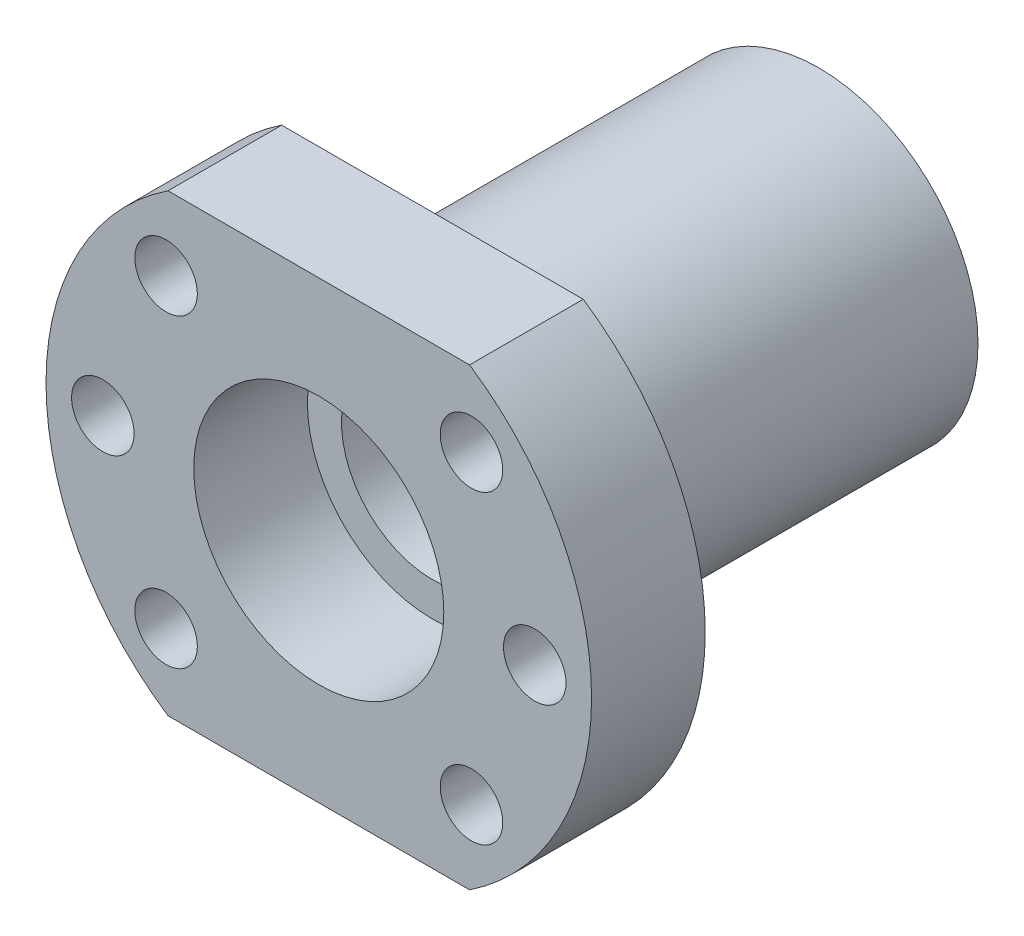
ISO-10303-21;
HEADER;
FILE_DESCRIPTION(('STEP AP214'),'2;1');
FILE_NAME('part.step','',(''),(''),'','','');
FILE_SCHEMA(('AUTOMOTIVE_DESIGN { 1 0 10303 214 1 1 1 1 }'));
ENDSEC;
DATA;
#1=APPLICATION_CONTEXT('core data for automotive mechanical design processes');
#2=APPLICATION_PROTOCOL_DEFINITION('international standard','automotive_design',2000,#1);
#3=PRODUCT_CONTEXT('',#1,'mechanical');
#4=PRODUCT('Part','Part','',(#3));
#5=PRODUCT_RELATED_PRODUCT_CATEGORY('part','',(#4));
#6=PRODUCT_DEFINITION_FORMATION('','',#4);
#7=PRODUCT_DEFINITION_CONTEXT('part definition',#1,'design');
#8=PRODUCT_DEFINITION('design','',#6,#7);
#9=PRODUCT_DEFINITION_SHAPE('','',#8);
#10=(LENGTH_UNIT() NAMED_UNIT(*) SI_UNIT(.MILLI.,.METRE.));
#11=(NAMED_UNIT(*) PLANE_ANGLE_UNIT() SI_UNIT($,.RADIAN.));
#12=(NAMED_UNIT(*) SI_UNIT($,.STERADIAN.) SOLID_ANGLE_UNIT());
#13=UNCERTAINTY_MEASURE_WITH_UNIT(LENGTH_MEASURE(1.E-05),#10,'distance_accuracy_value','');
#14=(GEOMETRIC_REPRESENTATION_CONTEXT(3) GLOBAL_UNCERTAINTY_ASSIGNED_CONTEXT((#13)) GLOBAL_UNIT_ASSIGNED_CONTEXT((#10,
#11,#12)) REPRESENTATION_CONTEXT('',''));
#15=CARTESIAN_POINT('',(0.,0.,0.));
#16=DIRECTION('',(0.,0.,1.));
#17=DIRECTION('',(1.,0.,0.));
#18=AXIS2_PLACEMENT_3D('',#15,#16,#17);
#19=CARTESIAN_POINT('',(0.,0.,17.9282770822245));
#20=DIRECTION('',(0.,0.,1.));
#21=DIRECTION('',(1.,0.,0.));
#22=AXIS2_PLACEMENT_3D('',#19,#20,#21);
#23=CYLINDRICAL_SURFACE('',#22,24.);
#24=CARTESIAN_POINT('',(0.,0.,12.));
#25=DIRECTION('',(0.,0.,1.));
#26=DIRECTION('',(1.,0.,0.));
#27=AXIS2_PLACEMENT_3D('',#24,#25,#26);
#28=CIRCLE('',#27,24.);
#29=CARTESIAN_POINT('',(-13.2664991614216,20.,12.));
#30=VERTEX_POINT('',#29);
#31=CARTESIAN_POINT('',(-13.2664991614216,-20.,12.));
#32=VERTEX_POINT('',#31);
#33=EDGE_CURVE('E93',#30,#32,#28,.T.);
#34=ORIENTED_EDGE('',*,*,#33,.T.);
#35=DIRECTION('',(0.,0.,1.));
#36=VECTOR('',#35,1.);
#37=CARTESIAN_POINT('',(-13.2664991614216,-20.,17.9282770822245));
#38=LINE('',#37,#36);
#39=CARTESIAN_POINT('',(-13.2664991614216,-20.,22.));
#40=VERTEX_POINT('',#39);
#41=EDGE_CURVE('E51',#32,#40,#38,.T.);
#42=ORIENTED_EDGE('',*,*,#41,.T.);
#43=CARTESIAN_POINT('',(0.,0.,22.));
#44=DIRECTION('',(0.,0.,1.));
#45=DIRECTION('',(1.,0.,0.));
#46=AXIS2_PLACEMENT_3D('',#43,#44,#45);
#47=CIRCLE('',#46,24.);
#48=CARTESIAN_POINT('',(-13.2664991614216,20.,22.));
#49=VERTEX_POINT('',#48);
#50=EDGE_CURVE('E88',#49,#40,#47,.T.);
#51=ORIENTED_EDGE('',*,*,#50,.F.);
#52=DIRECTION('',(0.,0.,1.));
#53=VECTOR('',#52,1.);
#54=CARTESIAN_POINT('',(-13.2664991614216,20.,17.9282770822245));
#55=LINE('',#54,#53);
#56=EDGE_CURVE('E149',#49,#30,#55,.F.);
#57=ORIENTED_EDGE('',*,*,#56,.T.);
#58=EDGE_LOOP('',(#34,#42,#51,#57));
#59=FACE_BOUND('',#58,.T.);
#60=ADVANCED_FACE('F34',(#59),#23,.T.);
#61=CARTESIAN_POINT('',(0.,14.,-22.));
#62=DIRECTION('',(0.,0.,1.));
#63=DIRECTION('',(1.,0.,0.));
#64=AXIS2_PLACEMENT_3D('',#61,#62,#63);
#65=PLANE('',#64);
#66=CARTESIAN_POINT('',(0.,0.,-22.));
#67=DIRECTION('',(0.,0.,1.));
#68=DIRECTION('',(1.,0.,0.));
#69=AXIS2_PLACEMENT_3D('',#66,#67,#68);
#70=CIRCLE('',#69,14.);
#71=CARTESIAN_POINT('',(14.,0.,-22.));
#72=VERTEX_POINT('',#71);
#73=EDGE_CURVE('E153',#72,#72,#70,.T.);
#74=ORIENTED_EDGE('',*,*,#73,.F.);
#75=EDGE_LOOP('',(#74));
#76=FACE_BOUND('',#75,.T.);
#77=CARTESIAN_POINT('',(0.,0.,-22.));
#78=DIRECTION('',(0.,0.,1.));
#79=DIRECTION('',(1.,0.,0.));
#80=AXIS2_PLACEMENT_3D('',#77,#78,#79);
#81=CIRCLE('',#80,11.);
#82=CARTESIAN_POINT('',(11.,0.,-22.));
#83=VERTEX_POINT('',#82);
#84=EDGE_CURVE('E114',#83,#83,#81,.T.);
#85=ORIENTED_EDGE('',*,*,#84,.T.);
#86=EDGE_LOOP('',(#85));
#87=FACE_BOUND('',#86,.T.);
#88=ADVANCED_FACE('F36',(#76,#87),#65,.F.);
#89=CARTESIAN_POINT('',(0.,0.,17.9282770822245));
#90=DIRECTION('',(0.,0.,1.));
#91=DIRECTION('',(1.,0.,0.));
#92=AXIS2_PLACEMENT_3D('',#89,#90,#91);
#93=CYLINDRICAL_SURFACE('',#92,11.);
#94=ORIENTED_EDGE('',*,*,#84,.F.);
#95=EDGE_LOOP('',(#94));
#96=FACE_BOUND('',#95,.T.);
#97=CARTESIAN_POINT('',(0.,0.,-12.));
#98=DIRECTION('',(0.,0.,1.));
#99=DIRECTION('',(1.,0.,0.));
#100=AXIS2_PLACEMENT_3D('',#97,#98,#99);
#101=CIRCLE('',#100,11.);
#102=CARTESIAN_POINT('',(11.,0.,-12.));
#103=VERTEX_POINT('',#102);
#104=EDGE_CURVE('E111',#103,#103,#101,.T.);
#105=ORIENTED_EDGE('',*,*,#104,.T.);
#106=EDGE_LOOP('',(#105));
#107=FACE_BOUND('',#106,.T.);
#108=ADVANCED_FACE('F170',(#96,#107),#93,.F.);
#109=CARTESIAN_POINT('',(0.,11.,-12.));
#110=DIRECTION('',(0.,0.,1.));
#111=DIRECTION('',(1.,0.,0.));
#112=AXIS2_PLACEMENT_3D('',#109,#110,#111);
#113=PLANE('',#112);
#114=ORIENTED_EDGE('',*,*,#104,.F.);
#115=EDGE_LOOP('',(#114));
#116=FACE_BOUND('',#115,.T.);
#117=CARTESIAN_POINT('',(0.,0.,-12.));
#118=DIRECTION('',(0.,0.,1.));
#119=DIRECTION('',(1.,0.,0.));
#120=AXIS2_PLACEMENT_3D('',#117,#118,#119);
#121=CIRCLE('',#120,8.);
#122=CARTESIAN_POINT('',(8.,0.,-12.));
#123=VERTEX_POINT('',#122);
#124=EDGE_CURVE('E108',#123,#123,#121,.T.);
#125=ORIENTED_EDGE('',*,*,#124,.T.);
#126=EDGE_LOOP('',(#125));
#127=FACE_BOUND('',#126,.T.);
#128=ADVANCED_FACE('F175',(#116,#127),#113,.F.);
#129=CARTESIAN_POINT('',(0.,0.,17.9282770822245));
#130=DIRECTION('',(0.,0.,1.));
#131=DIRECTION('',(1.,0.,0.));
#132=AXIS2_PLACEMENT_3D('',#129,#130,#131);
#133=CYLINDRICAL_SURFACE('',#132,8.);
#134=ORIENTED_EDGE('',*,*,#124,.F.);
#135=EDGE_LOOP('',(#134));
#136=FACE_BOUND('',#135,.T.);
#137=CARTESIAN_POINT('',(0.,0.,12.));
#138=DIRECTION('',(0.,0.,1.));
#139=DIRECTION('',(1.,0.,0.));
#140=AXIS2_PLACEMENT_3D('',#137,#138,#139);
#141=CIRCLE('',#140,8.);
#142=CARTESIAN_POINT('',(8.,0.,12.));
#143=VERTEX_POINT('',#142);
#144=EDGE_CURVE('E105',#143,#143,#141,.T.);
#145=ORIENTED_EDGE('',*,*,#144,.T.);
#146=EDGE_LOOP('',(#145));
#147=FACE_BOUND('',#146,.T.);
#148=ADVANCED_FACE('F180',(#136,#147),#133,.F.);
#149=CARTESIAN_POINT('',(0.,11.,12.));
#150=DIRECTION('',(0.,0.,-1.));
#151=DIRECTION('',(-1.,0.,0.));
#152=AXIS2_PLACEMENT_3D('',#149,#150,#151);
#153=PLANE('',#152);
#154=ORIENTED_EDGE('',*,*,#144,.F.);
#155=EDGE_LOOP('',(#154));
#156=FACE_BOUND('',#155,.T.);
#157=CARTESIAN_POINT('',(0.,0.,12.));
#158=DIRECTION('',(0.,0.,1.));
#159=DIRECTION('',(1.,0.,0.));
#160=AXIS2_PLACEMENT_3D('',#157,#158,#159);
#161=CIRCLE('',#160,11.);
#162=CARTESIAN_POINT('',(11.,0.,12.));
#163=VERTEX_POINT('',#162);
#164=EDGE_CURVE('E102',#163,#163,#161,.T.);
#165=ORIENTED_EDGE('',*,*,#164,.T.);
#166=EDGE_LOOP('',(#165));
#167=FACE_BOUND('',#166,.T.);
#168=ADVANCED_FACE('F186',(#156,#167),#153,.F.);
#169=CARTESIAN_POINT('',(0.,0.,17.9282770822245));
#170=DIRECTION('',(0.,0.,1.));
#171=DIRECTION('',(1.,0.,0.));
#172=AXIS2_PLACEMENT_3D('',#169,#170,#171);
#173=CYLINDRICAL_SURFACE('',#172,11.);
#174=ORIENTED_EDGE('',*,*,#164,.F.);
#175=EDGE_LOOP('',(#174));
#176=FACE_BOUND('',#175,.T.);
#177=CARTESIAN_POINT('',(0.,0.,22.));
#178=DIRECTION('',(0.,0.,1.));
#179=DIRECTION('',(1.,0.,0.));
#180=AXIS2_PLACEMENT_3D('',#177,#178,#179);
#181=CIRCLE('',#180,11.);
#182=CARTESIAN_POINT('',(11.,0.,22.));
#183=VERTEX_POINT('',#182);
#184=EDGE_CURVE('E95',#183,#183,#181,.T.);
#185=ORIENTED_EDGE('',*,*,#184,.T.);
#186=EDGE_LOOP('',(#185));
#187=FACE_BOUND('',#186,.T.);
#188=ADVANCED_FACE('F192',(#176,#187),#173,.F.);
#189=CARTESIAN_POINT('',(0.,11.,22.));
#190=DIRECTION('',(0.,0.,-1.));
#191=DIRECTION('',(-1.,0.,0.));
#192=AXIS2_PLACEMENT_3D('',#189,#190,#191);
#193=PLANE('',#192);
#194=CARTESIAN_POINT('',(-13.4350288425444,13.4350288425444,22.));
#195=DIRECTION('',(0.,0.,1.));
#196=DIRECTION('',(1.,0.,0.));
#197=AXIS2_PLACEMENT_3D('',#194,#195,#196);
#198=CIRCLE('',#197,2.75);
#199=CARTESIAN_POINT('',(-10.6850288425444,13.4350288425444,22.));
#200=VERTEX_POINT('',#199);
#201=EDGE_CURVE('E126',#200,#200,#198,.T.);
#202=ORIENTED_EDGE('',*,*,#201,.F.);
#203=EDGE_LOOP('',(#202));
#204=FACE_BOUND('',#203,.T.);
#205=CARTESIAN_POINT('',(13.4350288425444,13.4350288425444,22.));
#206=DIRECTION('',(0.,0.,1.));
#207=DIRECTION('',(1.,0.,0.));
#208=AXIS2_PLACEMENT_3D('',#205,#206,#207);
#209=CIRCLE('',#208,2.75);
#210=CARTESIAN_POINT('',(16.1850288425444,13.4350288425444,22.));
#211=VERTEX_POINT('',#210);
#212=EDGE_CURVE('E248',#211,#211,#209,.T.);
#213=ORIENTED_EDGE('',*,*,#212,.F.);
#214=EDGE_LOOP('',(#213));
#215=FACE_BOUND('',#214,.T.);
#216=CARTESIAN_POINT('',(19.,0.,22.));
#217=DIRECTION('',(0.,0.,1.));
#218=DIRECTION('',(1.,0.,0.));
#219=AXIS2_PLACEMENT_3D('',#216,#217,#218);
#220=CIRCLE('',#219,2.75);
#221=CARTESIAN_POINT('',(21.75,0.,22.));
#222=VERTEX_POINT('',#221);
#223=EDGE_CURVE('E251',#222,#222,#220,.T.);
#224=ORIENTED_EDGE('',*,*,#223,.F.);
#225=EDGE_LOOP('',(#224));
#226=FACE_BOUND('',#225,.T.);
#227=CARTESIAN_POINT('',(13.4350288425444,-13.4350288425444,22.));
#228=DIRECTION('',(0.,0.,1.));
#229=DIRECTION('',(1.,0.,0.));
#230=AXIS2_PLACEMENT_3D('',#227,#228,#229);
#231=CIRCLE('',#230,2.75);
#232=CARTESIAN_POINT('',(16.1850288425444,-13.4350288425444,22.));
#233=VERTEX_POINT('',#232);
#234=EDGE_CURVE('E255',#233,#233,#231,.T.);
#235=ORIENTED_EDGE('',*,*,#234,.F.);
#236=EDGE_LOOP('',(#235));
#237=FACE_BOUND('',#236,.T.);
#238=CARTESIAN_POINT('',(-13.4350288425444,-13.4350288425444,22.));
#239=DIRECTION('',(0.,0.,1.));
#240=DIRECTION('',(1.,0.,0.));
#241=AXIS2_PLACEMENT_3D('',#238,#239,#240);
#242=CIRCLE('',#241,2.75);
#243=CARTESIAN_POINT('',(-10.6850288425444,-13.4350288425444,22.));
#244=VERTEX_POINT('',#243);
#245=EDGE_CURVE('E143',#244,#244,#242,.T.);
#246=ORIENTED_EDGE('',*,*,#245,.F.);
#247=EDGE_LOOP('',(#246));
#248=FACE_BOUND('',#247,.T.);
#249=CARTESIAN_POINT('',(-19.,0.,22.));
#250=DIRECTION('',(0.,0.,1.));
#251=DIRECTION('',(1.,0.,0.));
#252=AXIS2_PLACEMENT_3D('',#249,#250,#251);
#253=CIRCLE('',#252,2.75);
#254=CARTESIAN_POINT('',(-16.25,0.,22.));
#255=VERTEX_POINT('',#254);
#256=EDGE_CURVE('E121',#255,#255,#253,.T.);
#257=ORIENTED_EDGE('',*,*,#256,.F.);
#258=EDGE_LOOP('',(#257));
#259=FACE_BOUND('',#258,.T.);
#260=ORIENTED_EDGE('',*,*,#184,.F.);
#261=EDGE_LOOP('',(#260));
#262=FACE_BOUND('',#261,.T.);
#263=ORIENTED_EDGE('',*,*,#50,.T.);
#264=DIRECTION('',(-1.,0.,0.));
#265=VECTOR('',#264,1.);
#266=CARTESIAN_POINT('',(20.,-20.,22.));
#267=LINE('',#266,#265);
#268=CARTESIAN_POINT('',(13.2664991614216,-20.,22.));
#269=VERTEX_POINT('',#268);
#270=EDGE_CURVE('E78',#269,#40,#267,.T.);
#271=ORIENTED_EDGE('',*,*,#270,.F.);
#272=CARTESIAN_POINT('',(13.2664991614216,20.,22.));
#273=VERTEX_POINT('',#272);
#274=EDGE_CURVE('E85',#269,#273,#47,.T.);
#275=ORIENTED_EDGE('',*,*,#274,.T.);
#276=DIRECTION('',(1.,0.,0.));
#277=VECTOR('',#276,1.);
#278=CARTESIAN_POINT('',(20.,20.,22.));
#279=LINE('',#278,#277);
#280=EDGE_CURVE('E147',#49,#273,#279,.T.);
#281=ORIENTED_EDGE('',*,*,#280,.F.);
#282=EDGE_LOOP('',(#263,#271,#275,#281));
#283=FACE_BOUND('',#282,.T.);
#284=ADVANCED_FACE('F83',(#204,#215,#226,#237,#248,#259,#262,#283),#193,.F.);
#285=ORIENTED_EDGE('',*,*,#274,.F.);
#286=DIRECTION('',(0.,0.,1.));
#287=VECTOR('',#286,1.);
#288=CARTESIAN_POINT('',(13.2664991614216,-20.,17.9282770822245));
#289=LINE('',#288,#287);
#290=CARTESIAN_POINT('',(13.2664991614216,-20.,12.));
#291=VERTEX_POINT('',#290);
#292=EDGE_CURVE('E75',#269,#291,#289,.F.);
#293=ORIENTED_EDGE('',*,*,#292,.T.);
#294=CARTESIAN_POINT('',(13.2664991614216,20.,12.));
#295=VERTEX_POINT('',#294);
#296=EDGE_CURVE('E58',#291,#295,#28,.T.);
#297=ORIENTED_EDGE('',*,*,#296,.T.);
#298=DIRECTION('',(0.,0.,1.));
#299=VECTOR('',#298,1.);
#300=CARTESIAN_POINT('',(13.2664991614216,20.,17.9282770822245));
#301=LINE('',#300,#299);
#302=EDGE_CURVE('E92',#295,#273,#301,.T.);
#303=ORIENTED_EDGE('',*,*,#302,.T.);
#304=EDGE_LOOP('',(#285,#293,#297,#303));
#305=FACE_BOUND('',#304,.T.);
#306=ADVANCED_FACE('F91',(#305),#23,.T.);
#307=CARTESIAN_POINT('',(0.,24.,12.));
#308=DIRECTION('',(0.,0.,1.));
#309=DIRECTION('',(1.,0.,0.));
#310=AXIS2_PLACEMENT_3D('',#307,#308,#309);
#311=PLANE('',#310);
#312=CARTESIAN_POINT('',(-13.4350288425444,13.4350288425444,12.));
#313=DIRECTION('',(0.,0.,1.));
#314=DIRECTION('',(1.,0.,0.));
#315=AXIS2_PLACEMENT_3D('',#312,#313,#314);
#316=CIRCLE('',#315,2.75);
#317=CARTESIAN_POINT('',(-10.6850288425444,13.4350288425444,12.));
#318=VERTEX_POINT('',#317);
#319=EDGE_CURVE('E38',#318,#318,#316,.T.);
#320=ORIENTED_EDGE('',*,*,#319,.T.);
#321=EDGE_LOOP('',(#320));
#322=FACE_BOUND('',#321,.T.);
#323=CARTESIAN_POINT('',(13.4350288425444,13.4350288425444,12.));
#324=DIRECTION('',(0.,0.,1.));
#325=DIRECTION('',(1.,0.,0.));
#326=AXIS2_PLACEMENT_3D('',#323,#324,#325);
#327=CIRCLE('',#326,2.75);
#328=CARTESIAN_POINT('',(16.1850288425444,13.4350288425444,12.));
#329=VERTEX_POINT('',#328);
#330=EDGE_CURVE('E131',#329,#329,#327,.T.);
#331=ORIENTED_EDGE('',*,*,#330,.T.);
#332=EDGE_LOOP('',(#331));
#333=FACE_BOUND('',#332,.T.);
#334=CARTESIAN_POINT('',(19.,0.,12.));
#335=DIRECTION('',(0.,0.,1.));
#336=DIRECTION('',(1.,0.,0.));
#337=AXIS2_PLACEMENT_3D('',#334,#335,#336);
#338=CIRCLE('',#337,2.75);
#339=CARTESIAN_POINT('',(21.75,0.,12.));
#340=VERTEX_POINT('',#339);
#341=EDGE_CURVE('E129',#340,#340,#338,.T.);
#342=ORIENTED_EDGE('',*,*,#341,.T.);
#343=EDGE_LOOP('',(#342));
#344=FACE_BOUND('',#343,.T.);
#345=CARTESIAN_POINT('',(13.4350288425444,-13.4350288425444,12.));
#346=DIRECTION('',(0.,0.,1.));
#347=DIRECTION('',(1.,0.,0.));
#348=AXIS2_PLACEMENT_3D('',#345,#346,#347);
#349=CIRCLE('',#348,2.75);
#350=CARTESIAN_POINT('',(16.1850288425444,-13.4350288425444,12.));
#351=VERTEX_POINT('',#350);
#352=EDGE_CURVE('E125',#351,#351,#349,.T.);
#353=ORIENTED_EDGE('',*,*,#352,.T.);
#354=EDGE_LOOP('',(#353));
#355=FACE_BOUND('',#354,.T.);
#356=CARTESIAN_POINT('',(-13.4350288425444,-13.4350288425444,12.));
#357=DIRECTION('',(0.,0.,1.));
#358=DIRECTION('',(1.,0.,0.));
#359=AXIS2_PLACEMENT_3D('',#356,#357,#358);
#360=CIRCLE('',#359,2.75);
#361=CARTESIAN_POINT('',(-10.6850288425444,-13.4350288425444,12.));
#362=VERTEX_POINT('',#361);
#363=EDGE_CURVE('E122',#362,#362,#360,.T.);
#364=ORIENTED_EDGE('',*,*,#363,.T.);
#365=EDGE_LOOP('',(#364));
#366=FACE_BOUND('',#365,.T.);
#367=CARTESIAN_POINT('',(-19.,0.,12.));
#368=DIRECTION('',(0.,0.,1.));
#369=DIRECTION('',(1.,0.,0.));
#370=AXIS2_PLACEMENT_3D('',#367,#368,#369);
#371=CIRCLE('',#370,2.75);
#372=CARTESIAN_POINT('',(-16.25,0.,12.));
#373=VERTEX_POINT('',#372);
#374=EDGE_CURVE('E89',#373,#373,#371,.T.);
#375=ORIENTED_EDGE('',*,*,#374,.T.);
#376=EDGE_LOOP('',(#375));
#377=FACE_BOUND('',#376,.T.);
#378=ORIENTED_EDGE('',*,*,#296,.F.);
#379=DIRECTION('',(-1.,0.,0.));
#380=VECTOR('',#379,1.);
#381=CARTESIAN_POINT('',(0.,-20.,12.));
#382=LINE('',#381,#380);
#383=EDGE_CURVE('E11',#291,#32,#382,.T.);
#384=ORIENTED_EDGE('',*,*,#383,.T.);
#385=ORIENTED_EDGE('',*,*,#33,.F.);
#386=DIRECTION('',(1.,0.,0.));
#387=VECTOR('',#386,1.);
#388=CARTESIAN_POINT('',(0.,20.,12.));
#389=LINE('',#388,#387);
#390=EDGE_CURVE('E43',#30,#295,#389,.T.);
#391=ORIENTED_EDGE('',*,*,#390,.T.);
#392=EDGE_LOOP('',(#378,#384,#385,#391));
#393=FACE_BOUND('',#392,.T.);
#394=CARTESIAN_POINT('',(0.,0.,12.));
#395=DIRECTION('',(0.,0.,1.));
#396=DIRECTION('',(1.,0.,0.));
#397=AXIS2_PLACEMENT_3D('',#394,#395,#396);
#398=CIRCLE('',#397,14.);
#399=CARTESIAN_POINT('',(14.,0.,12.));
#400=VERTEX_POINT('',#399);
#401=EDGE_CURVE('E155',#400,#400,#398,.T.);
#402=ORIENTED_EDGE('',*,*,#401,.T.);
#403=EDGE_LOOP('',(#402));
#404=FACE_BOUND('',#403,.T.);
#405=ADVANCED_FACE('F159',(#322,#333,#344,#355,#366,#377,#393,#404),#311,.F.);
#406=CARTESIAN_POINT('',(0.,0.,17.9282770822245));
#407=DIRECTION('',(0.,0.,1.));
#408=DIRECTION('',(1.,0.,0.));
#409=AXIS2_PLACEMENT_3D('',#406,#407,#408);
#410=CYLINDRICAL_SURFACE('',#409,14.);
#411=ORIENTED_EDGE('',*,*,#401,.F.);
#412=EDGE_LOOP('',(#411));
#413=FACE_BOUND('',#412,.T.);
#414=ORIENTED_EDGE('',*,*,#73,.T.);
#415=EDGE_LOOP('',(#414));
#416=FACE_BOUND('',#415,.T.);
#417=ADVANCED_FACE('F161',(#413,#416),#410,.T.);
#418=CARTESIAN_POINT('',(20.,20.,-22.));
#419=DIRECTION('',(0.,-1.,0.));
#420=DIRECTION('',(1.,0.,0.));
#421=AXIS2_PLACEMENT_3D('',#418,#419,#420);
#422=PLANE('',#421);
#423=ORIENTED_EDGE('',*,*,#390,.F.);
#424=ORIENTED_EDGE('',*,*,#56,.F.);
#425=ORIENTED_EDGE('',*,*,#280,.T.);
#426=ORIENTED_EDGE('',*,*,#302,.F.);
#427=EDGE_LOOP('',(#423,#424,#425,#426));
#428=FACE_BOUND('',#427,.T.);
#429=ADVANCED_FACE('F164',(#428),#422,.F.);
#430=CARTESIAN_POINT('',(20.,-20.,-22.));
#431=DIRECTION('',(0.,1.,0.));
#432=DIRECTION('',(-1.,0.,0.));
#433=AXIS2_PLACEMENT_3D('',#430,#431,#432);
#434=PLANE('',#433);
#435=ORIENTED_EDGE('',*,*,#383,.F.);
#436=ORIENTED_EDGE('',*,*,#292,.F.);
#437=ORIENTED_EDGE('',*,*,#270,.T.);
#438=ORIENTED_EDGE('',*,*,#41,.F.);
#439=EDGE_LOOP('',(#435,#436,#437,#438));
#440=FACE_BOUND('',#439,.T.);
#441=ADVANCED_FACE('F77',(#440),#434,.F.);
#442=CARTESIAN_POINT('',(-19.,0.,-22.));
#443=DIRECTION('',(0.,0.,1.));
#444=DIRECTION('',(1.,0.,0.));
#445=AXIS2_PLACEMENT_3D('',#442,#443,#444);
#446=CYLINDRICAL_SURFACE('',#445,2.75);
#447=ORIENTED_EDGE('',*,*,#256,.T.);
#448=EDGE_LOOP('',(#447));
#449=FACE_BOUND('',#448,.T.);
#450=ORIENTED_EDGE('',*,*,#374,.F.);
#451=EDGE_LOOP('',(#450));
#452=FACE_BOUND('',#451,.T.);
#453=ADVANCED_FACE('F222',(#449,#452),#446,.F.);
#454=CARTESIAN_POINT('',(-13.4350288425444,-13.4350288425444,-22.));
#455=DIRECTION('',(0.,0.,1.));
#456=DIRECTION('',(1.,0.,0.));
#457=AXIS2_PLACEMENT_3D('',#454,#455,#456);
#458=CYLINDRICAL_SURFACE('',#457,2.75);
#459=ORIENTED_EDGE('',*,*,#245,.T.);
#460=EDGE_LOOP('',(#459));
#461=FACE_BOUND('',#460,.T.);
#462=ORIENTED_EDGE('',*,*,#363,.F.);
#463=EDGE_LOOP('',(#462));
#464=FACE_BOUND('',#463,.T.);
#465=ADVANCED_FACE('F225',(#461,#464),#458,.F.);
#466=CARTESIAN_POINT('',(13.4350288425444,-13.4350288425444,-22.));
#467=DIRECTION('',(0.,0.,1.));
#468=DIRECTION('',(1.,0.,0.));
#469=AXIS2_PLACEMENT_3D('',#466,#467,#468);
#470=CYLINDRICAL_SURFACE('',#469,2.75);
#471=ORIENTED_EDGE('',*,*,#234,.T.);
#472=EDGE_LOOP('',(#471));
#473=FACE_BOUND('',#472,.T.);
#474=ORIENTED_EDGE('',*,*,#352,.F.);
#475=EDGE_LOOP('',(#474));
#476=FACE_BOUND('',#475,.T.);
#477=ADVANCED_FACE('F228',(#473,#476),#470,.F.);
#478=CARTESIAN_POINT('',(19.,0.,-22.));
#479=DIRECTION('',(0.,0.,1.));
#480=DIRECTION('',(1.,0.,0.));
#481=AXIS2_PLACEMENT_3D('',#478,#479,#480);
#482=CYLINDRICAL_SURFACE('',#481,2.75);
#483=ORIENTED_EDGE('',*,*,#223,.T.);
#484=EDGE_LOOP('',(#483));
#485=FACE_BOUND('',#484,.T.);
#486=ORIENTED_EDGE('',*,*,#341,.F.);
#487=EDGE_LOOP('',(#486));
#488=FACE_BOUND('',#487,.T.);
#489=ADVANCED_FACE('F232',(#485,#488),#482,.F.);
#490=CARTESIAN_POINT('',(13.4350288425444,13.4350288425444,-22.));
#491=DIRECTION('',(0.,0.,1.));
#492=DIRECTION('',(1.,0.,0.));
#493=AXIS2_PLACEMENT_3D('',#490,#491,#492);
#494=CYLINDRICAL_SURFACE('',#493,2.75);
#495=ORIENTED_EDGE('',*,*,#212,.T.);
#496=EDGE_LOOP('',(#495));
#497=FACE_BOUND('',#496,.T.);
#498=ORIENTED_EDGE('',*,*,#330,.F.);
#499=EDGE_LOOP('',(#498));
#500=FACE_BOUND('',#499,.T.);
#501=ADVANCED_FACE('F236',(#497,#500),#494,.F.);
#502=CARTESIAN_POINT('',(-13.4350288425444,13.4350288425444,-22.));
#503=DIRECTION('',(0.,0.,1.));
#504=DIRECTION('',(1.,0.,0.));
#505=AXIS2_PLACEMENT_3D('',#502,#503,#504);
#506=CYLINDRICAL_SURFACE('',#505,2.75);
#507=ORIENTED_EDGE('',*,*,#201,.T.);
#508=EDGE_LOOP('',(#507));
#509=FACE_BOUND('',#508,.T.);
#510=ORIENTED_EDGE('',*,*,#319,.F.);
#511=EDGE_LOOP('',(#510));
#512=FACE_BOUND('',#511,.T.);
#513=ADVANCED_FACE('F240',(#509,#512),#506,.F.);
#514=CLOSED_SHELL('',(#60,#88,#108,#128,#148,#168,#188,#284,#306,#405,#417,#429,#441,#453,#465,
#477,#489,#501,#513));
#515=MANIFOLD_SOLID_BREP('B2',#514);
#516=ADVANCED_BREP_SHAPE_REPRESENTATION('',(#18,#515),#14);
#517=SHAPE_DEFINITION_REPRESENTATION(#9,#516);
ENDSEC;
END-ISO-10303-21;
